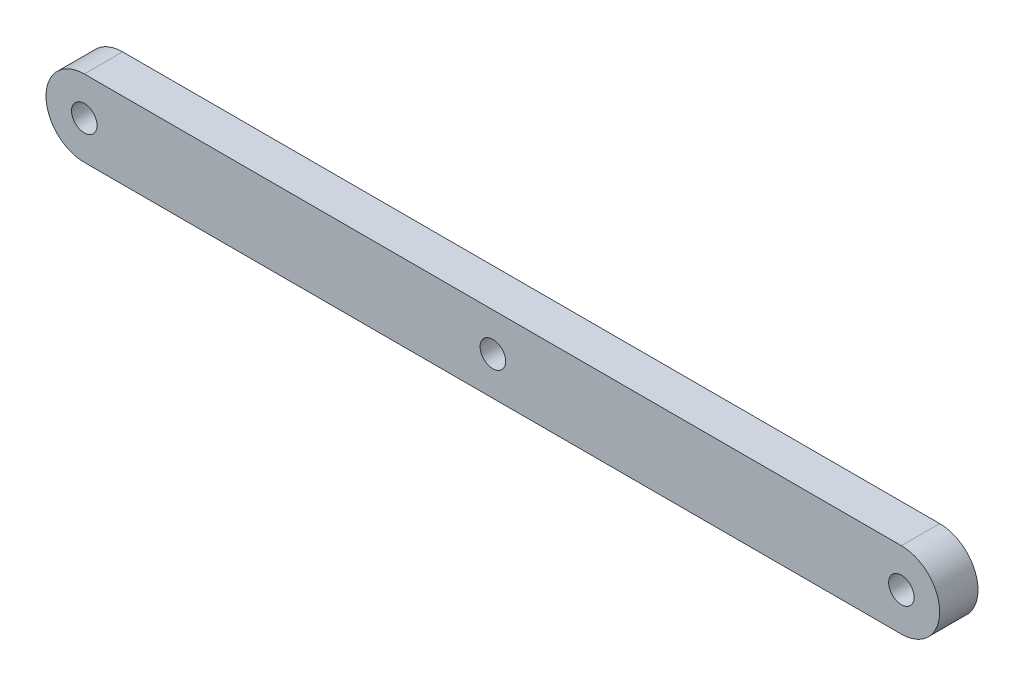
ISO-10303-21;
HEADER;
FILE_DESCRIPTION(('STEP AP214'),'2;1');
FILE_NAME('part.step','',(''),(''),'','','');
FILE_SCHEMA(('AUTOMOTIVE_DESIGN { 1 0 10303 214 1 1 1 1 }'));
ENDSEC;
DATA;
#1=APPLICATION_CONTEXT('core data for automotive mechanical design processes');
#2=APPLICATION_PROTOCOL_DEFINITION('international standard','automotive_design',2000,#1);
#3=PRODUCT_CONTEXT('',#1,'mechanical');
#4=PRODUCT('Part','Part','',(#3));
#5=PRODUCT_RELATED_PRODUCT_CATEGORY('part','',(#4));
#6=PRODUCT_DEFINITION_FORMATION('','',#4);
#7=PRODUCT_DEFINITION_CONTEXT('part definition',#1,'design');
#8=PRODUCT_DEFINITION('design','',#6,#7);
#9=PRODUCT_DEFINITION_SHAPE('','',#8);
#10=(LENGTH_UNIT() NAMED_UNIT(*) SI_UNIT(.MILLI.,.METRE.));
#11=(NAMED_UNIT(*) PLANE_ANGLE_UNIT() SI_UNIT($,.RADIAN.));
#12=(NAMED_UNIT(*) SI_UNIT($,.STERADIAN.) SOLID_ANGLE_UNIT());
#13=UNCERTAINTY_MEASURE_WITH_UNIT(LENGTH_MEASURE(1.E-05),#10,'distance_accuracy_value','');
#14=(GEOMETRIC_REPRESENTATION_CONTEXT(3) GLOBAL_UNCERTAINTY_ASSIGNED_CONTEXT((#13)) GLOBAL_UNIT_ASSIGNED_CONTEXT((#10,
#11,#12)) REPRESENTATION_CONTEXT('',''));
#15=CARTESIAN_POINT('',(0.,0.,0.));
#16=DIRECTION('',(0.,0.,1.));
#17=DIRECTION('',(1.,0.,0.));
#18=AXIS2_PLACEMENT_3D('',#15,#16,#17);
#19=CARTESIAN_POINT('',(53.,1.00000000000001,3.));
#20=DIRECTION('',(0.,0.,1.));
#21=DIRECTION('',(1.,0.,0.));
#22=AXIS2_PLACEMENT_3D('',#19,#20,#21);
#23=PLANE('',#22);
#24=CARTESIAN_POINT('',(53.,1.00000000000001,3.));
#25=DIRECTION('',(0.,0.,1.));
#26=DIRECTION('',(1.,0.,0.));
#27=AXIS2_PLACEMENT_3D('',#24,#25,#26);
#28=CIRCLE('',#27,0.999999999999998);
#29=CARTESIAN_POINT('',(54.,1.00000000000001,3.));
#30=VERTEX_POINT('',#29);
#31=EDGE_CURVE('E134',#30,#30,#28,.T.);
#32=ORIENTED_EDGE('',*,*,#31,.F.);
#33=EDGE_LOOP('',(#32));
#34=FACE_BOUND('',#33,.T.);
#35=CARTESIAN_POINT('',(53.,1.00000000000001,3.));
#36=DIRECTION('',(0.,0.,1.));
#37=DIRECTION('',(1.,0.,0.));
#38=AXIS2_PLACEMENT_3D('',#35,#36,#37);
#39=CIRCLE('',#38,3.00000000000001);
#40=CARTESIAN_POINT('',(53.,-2.,3.));
#41=VERTEX_POINT('',#40);
#42=CARTESIAN_POINT('',(53.,4.00000000000001,3.));
#43=VERTEX_POINT('',#42);
#44=EDGE_CURVE('E92',#41,#43,#39,.T.);
#45=ORIENTED_EDGE('',*,*,#44,.T.);
#46=DIRECTION('',(-1.,0.,0.));
#47=VECTOR('',#46,1.);
#48=CARTESIAN_POINT('',(-11.,4.,3.));
#49=LINE('',#48,#47);
#50=CARTESIAN_POINT('',(-11.,4.,3.));
#51=VERTEX_POINT('',#50);
#52=EDGE_CURVE('E87',#43,#51,#49,.T.);
#53=ORIENTED_EDGE('',*,*,#52,.T.);
#54=CARTESIAN_POINT('',(-11.,1.,3.));
#55=DIRECTION('',(0.,0.,1.));
#56=DIRECTION('',(1.,0.,0.));
#57=AXIS2_PLACEMENT_3D('',#54,#55,#56);
#58=CIRCLE('',#57,3.);
#59=CARTESIAN_POINT('',(-11.,-2.,3.));
#60=VERTEX_POINT('',#59);
#61=EDGE_CURVE('E90',#51,#60,#58,.T.);
#62=ORIENTED_EDGE('',*,*,#61,.T.);
#63=DIRECTION('',(1.,0.,0.));
#64=VECTOR('',#63,1.);
#65=CARTESIAN_POINT('',(-11.,-2.,3.));
#66=LINE('',#65,#64);
#67=EDGE_CURVE('E57',#60,#41,#66,.T.);
#68=ORIENTED_EDGE('',*,*,#67,.T.);
#69=EDGE_LOOP('',(#45,#53,#62,#68));
#70=FACE_BOUND('',#69,.T.);
#71=CARTESIAN_POINT('',(-11.,1.,3.));
#72=DIRECTION('',(0.,0.,1.));
#73=DIRECTION('',(1.,0.,0.));
#74=AXIS2_PLACEMENT_3D('',#71,#72,#73);
#75=CIRCLE('',#74,1.);
#76=CARTESIAN_POINT('',(-10.,1.,3.));
#77=VERTEX_POINT('',#76);
#78=EDGE_CURVE('E112',#77,#77,#75,.T.);
#79=ORIENTED_EDGE('',*,*,#78,.F.);
#80=EDGE_LOOP('',(#79));
#81=FACE_BOUND('',#80,.T.);
#82=CARTESIAN_POINT('',(21.,1.,3.));
#83=DIRECTION('',(0.,0.,1.));
#84=DIRECTION('',(1.,0.,0.));
#85=AXIS2_PLACEMENT_3D('',#82,#83,#84);
#86=CIRCLE('',#85,1.);
#87=CARTESIAN_POINT('',(22.,1.,3.));
#88=VERTEX_POINT('',#87);
#89=EDGE_CURVE('E142',#88,#88,#86,.T.);
#90=ORIENTED_EDGE('',*,*,#89,.F.);
#91=EDGE_LOOP('',(#90));
#92=FACE_BOUND('',#91,.T.);
#93=ADVANCED_FACE('F39',(#34,#70,#81,#92),#23,.T.);
#94=CARTESIAN_POINT('',(53.,1.00000000000001,0.));
#95=DIRECTION('',(0.,0.,1.));
#96=DIRECTION('',(1.,0.,0.));
#97=AXIS2_PLACEMENT_3D('',#94,#95,#96);
#98=PLANE('',#97);
#99=CARTESIAN_POINT('',(53.,1.00000000000001,0.));
#100=DIRECTION('',(0.,0.,1.));
#101=DIRECTION('',(1.,0.,0.));
#102=AXIS2_PLACEMENT_3D('',#99,#100,#101);
#103=CIRCLE('',#102,3.00000000000001);
#104=CARTESIAN_POINT('',(53.,-2.,0.));
#105=VERTEX_POINT('',#104);
#106=CARTESIAN_POINT('',(53.,4.00000000000001,0.));
#107=VERTEX_POINT('',#106);
#108=EDGE_CURVE('E108',#105,#107,#103,.T.);
#109=ORIENTED_EDGE('',*,*,#108,.F.);
#110=DIRECTION('',(1.,0.,0.));
#111=VECTOR('',#110,1.);
#112=CARTESIAN_POINT('',(-11.,-2.,0.));
#113=LINE('',#112,#111);
#114=CARTESIAN_POINT('',(-11.,-2.,0.));
#115=VERTEX_POINT('',#114);
#116=EDGE_CURVE('E80',#115,#105,#113,.T.);
#117=ORIENTED_EDGE('',*,*,#116,.F.);
#118=CARTESIAN_POINT('',(-11.,1.,0.));
#119=DIRECTION('',(0.,0.,1.));
#120=DIRECTION('',(1.,0.,0.));
#121=AXIS2_PLACEMENT_3D('',#118,#119,#120);
#122=CIRCLE('',#121,3.);
#123=CARTESIAN_POINT('',(-11.,4.,0.));
#124=VERTEX_POINT('',#123);
#125=EDGE_CURVE('E74',#124,#115,#122,.T.);
#126=ORIENTED_EDGE('',*,*,#125,.F.);
#127=DIRECTION('',(-1.,0.,0.));
#128=VECTOR('',#127,1.);
#129=CARTESIAN_POINT('',(-11.,4.,0.));
#130=LINE('',#129,#128);
#131=EDGE_CURVE('E97',#107,#124,#130,.T.);
#132=ORIENTED_EDGE('',*,*,#131,.F.);
#133=EDGE_LOOP('',(#109,#117,#126,#132));
#134=FACE_BOUND('',#133,.T.);
#135=CARTESIAN_POINT('',(-11.,1.,0.));
#136=DIRECTION('',(0.,0.,1.));
#137=DIRECTION('',(1.,0.,0.));
#138=AXIS2_PLACEMENT_3D('',#135,#136,#137);
#139=CIRCLE('',#138,1.);
#140=CARTESIAN_POINT('',(-10.,1.,0.));
#141=VERTEX_POINT('',#140);
#142=EDGE_CURVE('E130',#141,#141,#139,.T.);
#143=ORIENTED_EDGE('',*,*,#142,.T.);
#144=EDGE_LOOP('',(#143));
#145=FACE_BOUND('',#144,.T.);
#146=CARTESIAN_POINT('',(53.,1.00000000000001,0.));
#147=DIRECTION('',(0.,0.,1.));
#148=DIRECTION('',(1.,0.,0.));
#149=AXIS2_PLACEMENT_3D('',#146,#147,#148);
#150=CIRCLE('',#149,0.999999999999998);
#151=CARTESIAN_POINT('',(54.,1.00000000000001,0.));
#152=VERTEX_POINT('',#151);
#153=EDGE_CURVE('E138',#152,#152,#150,.T.);
#154=ORIENTED_EDGE('',*,*,#153,.T.);
#155=EDGE_LOOP('',(#154));
#156=FACE_BOUND('',#155,.T.);
#157=CARTESIAN_POINT('',(21.,1.,0.));
#158=DIRECTION('',(0.,0.,1.));
#159=DIRECTION('',(1.,0.,0.));
#160=AXIS2_PLACEMENT_3D('',#157,#158,#159);
#161=CIRCLE('',#160,1.);
#162=CARTESIAN_POINT('',(22.,1.,0.));
#163=VERTEX_POINT('',#162);
#164=EDGE_CURVE('E146',#163,#163,#161,.T.);
#165=ORIENTED_EDGE('',*,*,#164,.T.);
#166=EDGE_LOOP('',(#165));
#167=FACE_BOUND('',#166,.T.);
#168=ADVANCED_FACE('F125',(#134,#145,#156,#167),#98,.F.);
#169=CARTESIAN_POINT('',(53.,1.00000000000001,3.));
#170=DIRECTION('',(0.,0.,-1.));
#171=DIRECTION('',(-1.,0.,0.));
#172=AXIS2_PLACEMENT_3D('',#169,#170,#171);
#173=CYLINDRICAL_SURFACE('',#172,3.00000000000001);
#174=ORIENTED_EDGE('',*,*,#108,.T.);
#175=DIRECTION('',(0.,0.,-1.));
#176=VECTOR('',#175,1.);
#177=CARTESIAN_POINT('',(53.,4.00000000000001,3.));
#178=LINE('',#177,#176);
#179=EDGE_CURVE('E11',#43,#107,#178,.T.);
#180=ORIENTED_EDGE('',*,*,#179,.F.);
#181=ORIENTED_EDGE('',*,*,#44,.F.);
#182=DIRECTION('',(0.,0.,-1.));
#183=VECTOR('',#182,1.);
#184=CARTESIAN_POINT('',(53.,-2.,3.));
#185=LINE('',#184,#183);
#186=EDGE_CURVE('E104',#41,#105,#185,.T.);
#187=ORIENTED_EDGE('',*,*,#186,.T.);
#188=EDGE_LOOP('',(#174,#180,#181,#187));
#189=FACE_BOUND('',#188,.T.);
#190=ADVANCED_FACE('F41',(#189),#173,.T.);
#191=CARTESIAN_POINT('',(-11.,4.,3.));
#192=DIRECTION('',(0.,-1.,0.));
#193=DIRECTION('',(1.,0.,0.));
#194=AXIS2_PLACEMENT_3D('',#191,#192,#193);
#195=PLANE('',#194);
#196=ORIENTED_EDGE('',*,*,#131,.T.);
#197=DIRECTION('',(0.,0.,-1.));
#198=VECTOR('',#197,1.);
#199=CARTESIAN_POINT('',(-11.,4.,3.));
#200=LINE('',#199,#198);
#201=EDGE_CURVE('E49',#51,#124,#200,.T.);
#202=ORIENTED_EDGE('',*,*,#201,.F.);
#203=ORIENTED_EDGE('',*,*,#52,.F.);
#204=ORIENTED_EDGE('',*,*,#179,.T.);
#205=EDGE_LOOP('',(#196,#202,#203,#204));
#206=FACE_BOUND('',#205,.T.);
#207=ADVANCED_FACE('F96',(#206),#195,.F.);
#208=CARTESIAN_POINT('',(-11.,1.,3.));
#209=DIRECTION('',(0.,0.,-1.));
#210=DIRECTION('',(-1.,0.,0.));
#211=AXIS2_PLACEMENT_3D('',#208,#209,#210);
#212=CYLINDRICAL_SURFACE('',#211,3.);
#213=ORIENTED_EDGE('',*,*,#125,.T.);
#214=DIRECTION('',(0.,0.,-1.));
#215=VECTOR('',#214,1.);
#216=CARTESIAN_POINT('',(-11.,-2.,3.));
#217=LINE('',#216,#215);
#218=EDGE_CURVE('E99',#60,#115,#217,.T.);
#219=ORIENTED_EDGE('',*,*,#218,.F.);
#220=ORIENTED_EDGE('',*,*,#61,.F.);
#221=ORIENTED_EDGE('',*,*,#201,.T.);
#222=EDGE_LOOP('',(#213,#219,#220,#221));
#223=FACE_BOUND('',#222,.T.);
#224=ADVANCED_FACE('F100',(#223),#212,.T.);
#225=CARTESIAN_POINT('',(-11.,-2.,3.));
#226=DIRECTION('',(0.,1.,0.));
#227=DIRECTION('',(0.,0.,1.));
#228=AXIS2_PLACEMENT_3D('',#225,#226,#227);
#229=PLANE('',#228);
#230=ORIENTED_EDGE('',*,*,#116,.T.);
#231=ORIENTED_EDGE('',*,*,#186,.F.);
#232=ORIENTED_EDGE('',*,*,#67,.F.);
#233=ORIENTED_EDGE('',*,*,#218,.T.);
#234=EDGE_LOOP('',(#230,#231,#232,#233));
#235=FACE_BOUND('',#234,.T.);
#236=ADVANCED_FACE('F122',(#235),#229,.F.);
#237=CARTESIAN_POINT('',(-11.,1.,3.));
#238=DIRECTION('',(0.,0.,-1.));
#239=DIRECTION('',(-1.,0.,0.));
#240=AXIS2_PLACEMENT_3D('',#237,#238,#239);
#241=CYLINDRICAL_SURFACE('',#240,1.);
#242=ORIENTED_EDGE('',*,*,#78,.T.);
#243=EDGE_LOOP('',(#242));
#244=FACE_BOUND('',#243,.T.);
#245=ORIENTED_EDGE('',*,*,#142,.F.);
#246=EDGE_LOOP('',(#245));
#247=FACE_BOUND('',#246,.T.);
#248=ADVANCED_FACE('F166',(#244,#247),#241,.F.);
#249=CARTESIAN_POINT('',(53.,1.00000000000001,3.));
#250=DIRECTION('',(0.,0.,-1.));
#251=DIRECTION('',(-1.,0.,0.));
#252=AXIS2_PLACEMENT_3D('',#249,#250,#251);
#253=CYLINDRICAL_SURFACE('',#252,0.999999999999998);
#254=ORIENTED_EDGE('',*,*,#31,.T.);
#255=EDGE_LOOP('',(#254));
#256=FACE_BOUND('',#255,.T.);
#257=ORIENTED_EDGE('',*,*,#153,.F.);
#258=EDGE_LOOP('',(#257));
#259=FACE_BOUND('',#258,.T.);
#260=ADVANCED_FACE('F212',(#256,#259),#253,.F.);
#261=CARTESIAN_POINT('',(21.,1.,3.));
#262=DIRECTION('',(0.,0.,-1.));
#263=DIRECTION('',(-1.,0.,0.));
#264=AXIS2_PLACEMENT_3D('',#261,#262,#263);
#265=CYLINDRICAL_SURFACE('',#264,1.);
#266=ORIENTED_EDGE('',*,*,#89,.T.);
#267=EDGE_LOOP('',(#266));
#268=FACE_BOUND('',#267,.T.);
#269=ORIENTED_EDGE('',*,*,#164,.F.);
#270=EDGE_LOOP('',(#269));
#271=FACE_BOUND('',#270,.T.);
#272=ADVANCED_FACE('F154',(#268,#271),#265,.F.);
#273=CLOSED_SHELL('',(#93,#168,#190,#207,#224,#236,#248,#260,#272));
#274=MANIFOLD_SOLID_BREP('B2',#273);
#275=ADVANCED_BREP_SHAPE_REPRESENTATION('',(#18,#274),#14);
#276=SHAPE_DEFINITION_REPRESENTATION(#9,#275);
ENDSEC;
END-ISO-10303-21;
